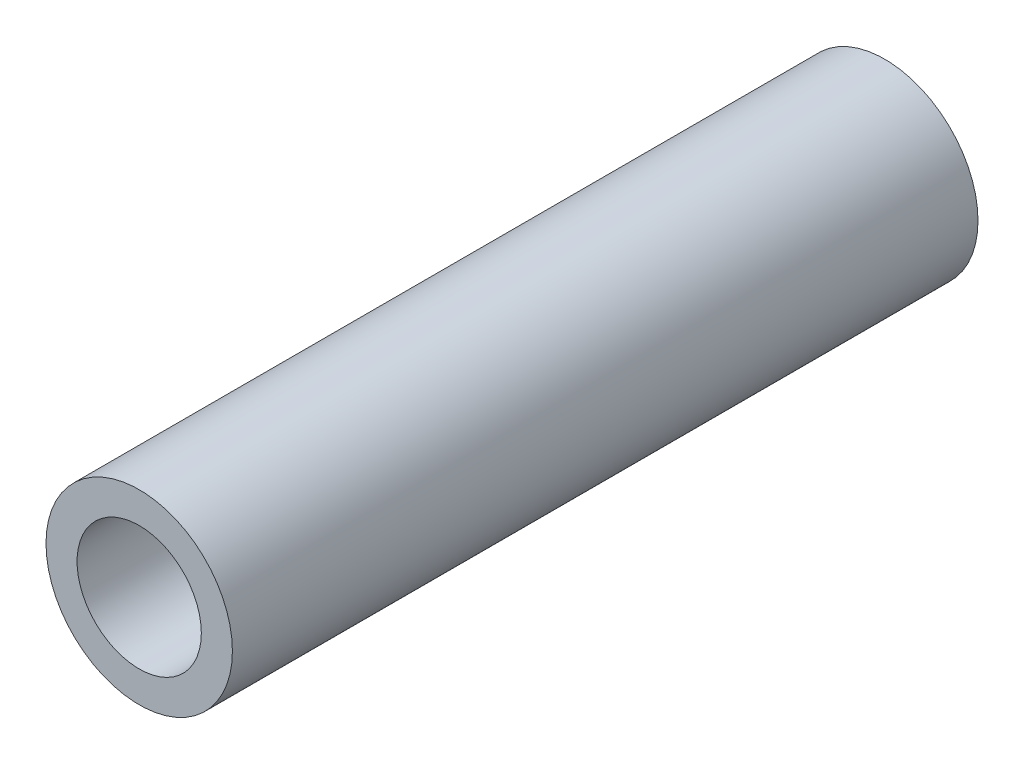
ISO-10303-21;
HEADER;
FILE_DESCRIPTION(('STEP AP214'),'2;1');
FILE_NAME('part.step','',(''),(''),'','','');
FILE_SCHEMA(('AUTOMOTIVE_DESIGN { 1 0 10303 214 1 1 1 1 }'));
ENDSEC;
DATA;
#1=APPLICATION_CONTEXT('core data for automotive mechanical design processes');
#2=APPLICATION_PROTOCOL_DEFINITION('international standard','automotive_design',2000,#1);
#3=PRODUCT_CONTEXT('',#1,'mechanical');
#4=PRODUCT('Part','Part','',(#3));
#5=PRODUCT_RELATED_PRODUCT_CATEGORY('part','',(#4));
#6=PRODUCT_DEFINITION_FORMATION('','',#4);
#7=PRODUCT_DEFINITION_CONTEXT('part definition',#1,'design');
#8=PRODUCT_DEFINITION('design','',#6,#7);
#9=PRODUCT_DEFINITION_SHAPE('','',#8);
#10=(LENGTH_UNIT() NAMED_UNIT(*) SI_UNIT(.MILLI.,.METRE.));
#11=(NAMED_UNIT(*) PLANE_ANGLE_UNIT() SI_UNIT($,.RADIAN.));
#12=(NAMED_UNIT(*) SI_UNIT($,.STERADIAN.) SOLID_ANGLE_UNIT());
#13=UNCERTAINTY_MEASURE_WITH_UNIT(LENGTH_MEASURE(1.E-05),#10,'distance_accuracy_value','');
#14=(GEOMETRIC_REPRESENTATION_CONTEXT(3) GLOBAL_UNCERTAINTY_ASSIGNED_CONTEXT((#13)) GLOBAL_UNIT_ASSIGNED_CONTEXT((#10,
#11,#12)) REPRESENTATION_CONTEXT('',''));
#15=CARTESIAN_POINT('',(0.,0.,0.));
#16=DIRECTION('',(0.,0.,1.));
#17=DIRECTION('',(1.,0.,0.));
#18=AXIS2_PLACEMENT_3D('',#15,#16,#17);
#19=CARTESIAN_POINT('',(0.,0.,38.1));
#20=DIRECTION('',(0.,0.,1.));
#21=DIRECTION('',(1.,0.,0.));
#22=AXIS2_PLACEMENT_3D('',#19,#20,#21);
#23=PLANE('',#22);
#24=CARTESIAN_POINT('',(0.,0.,38.1));
#25=DIRECTION('',(0.,0.,1.));
#26=DIRECTION('',(1.,0.,0.));
#27=AXIS2_PLACEMENT_3D('',#24,#25,#26);
#28=CIRCLE('',#27,4.7625);
#29=CARTESIAN_POINT('',(4.7625,0.,38.1));
#30=VERTEX_POINT('',#29);
#31=EDGE_CURVE('E10',#30,#30,#28,.T.);
#32=ORIENTED_EDGE('',*,*,#31,.T.);
#33=EDGE_LOOP('',(#32));
#34=FACE_BOUND('',#33,.T.);
#35=CARTESIAN_POINT('',(0.,0.,38.1));
#36=DIRECTION('',(0.,0.,1.));
#37=DIRECTION('',(1.,0.,0.));
#38=AXIS2_PLACEMENT_3D('',#35,#36,#37);
#39=CIRCLE('',#38,3.175);
#40=CARTESIAN_POINT('',(3.175,0.,38.1));
#41=VERTEX_POINT('',#40);
#42=EDGE_CURVE('E43',#41,#41,#39,.T.);
#43=ORIENTED_EDGE('',*,*,#42,.F.);
#44=EDGE_LOOP('',(#43));
#45=FACE_BOUND('',#44,.T.);
#46=ADVANCED_FACE('F32',(#34,#45),#23,.T.);
#47=CARTESIAN_POINT('',(0.,0.,0.));
#48=DIRECTION('',(0.,0.,1.));
#49=DIRECTION('',(1.,0.,0.));
#50=AXIS2_PLACEMENT_3D('',#47,#48,#49);
#51=PLANE('',#50);
#52=CARTESIAN_POINT('',(0.,0.,0.));
#53=DIRECTION('',(0.,0.,1.));
#54=DIRECTION('',(1.,0.,0.));
#55=AXIS2_PLACEMENT_3D('',#52,#53,#54);
#56=CIRCLE('',#55,4.7625);
#57=CARTESIAN_POINT('',(4.7625,0.,0.));
#58=VERTEX_POINT('',#57);
#59=EDGE_CURVE('E36',#58,#58,#56,.T.);
#60=ORIENTED_EDGE('',*,*,#59,.F.);
#61=EDGE_LOOP('',(#60));
#62=FACE_BOUND('',#61,.T.);
#63=CARTESIAN_POINT('',(0.,0.,0.));
#64=DIRECTION('',(0.,0.,1.));
#65=DIRECTION('',(1.,0.,0.));
#66=AXIS2_PLACEMENT_3D('',#63,#64,#65);
#67=CIRCLE('',#66,3.175);
#68=CARTESIAN_POINT('',(3.175,0.,0.));
#69=VERTEX_POINT('',#68);
#70=EDGE_CURVE('E45',#69,#69,#67,.T.);
#71=ORIENTED_EDGE('',*,*,#70,.T.);
#72=EDGE_LOOP('',(#71));
#73=FACE_BOUND('',#72,.T.);
#74=ADVANCED_FACE('F55',(#62,#73),#51,.F.);
#75=CARTESIAN_POINT('',(0.,0.,38.1));
#76=DIRECTION('',(0.,0.,-1.));
#77=DIRECTION('',(-1.,0.,0.));
#78=AXIS2_PLACEMENT_3D('',#75,#76,#77);
#79=CYLINDRICAL_SURFACE('',#78,4.7625);
#80=ORIENTED_EDGE('',*,*,#31,.F.);
#81=EDGE_LOOP('',(#80));
#82=FACE_BOUND('',#81,.T.);
#83=ORIENTED_EDGE('',*,*,#59,.T.);
#84=EDGE_LOOP('',(#83));
#85=FACE_BOUND('',#84,.T.);
#86=ADVANCED_FACE('F34',(#82,#85),#79,.T.);
#87=CARTESIAN_POINT('',(0.,0.,38.1));
#88=DIRECTION('',(0.,0.,-1.));
#89=DIRECTION('',(-1.,0.,0.));
#90=AXIS2_PLACEMENT_3D('',#87,#88,#89);
#91=CYLINDRICAL_SURFACE('',#90,3.175);
#92=ORIENTED_EDGE('',*,*,#42,.T.);
#93=EDGE_LOOP('',(#92));
#94=FACE_BOUND('',#93,.T.);
#95=ORIENTED_EDGE('',*,*,#70,.F.);
#96=EDGE_LOOP('',(#95));
#97=FACE_BOUND('',#96,.T.);
#98=ADVANCED_FACE('F51',(#94,#97),#91,.F.);
#99=CLOSED_SHELL('',(#46,#74,#86,#98));
#100=MANIFOLD_SOLID_BREP('B2',#99);
#101=ADVANCED_BREP_SHAPE_REPRESENTATION('',(#18,#100),#14);
#102=SHAPE_DEFINITION_REPRESENTATION(#9,#101);
ENDSEC;
END-ISO-10303-21;
